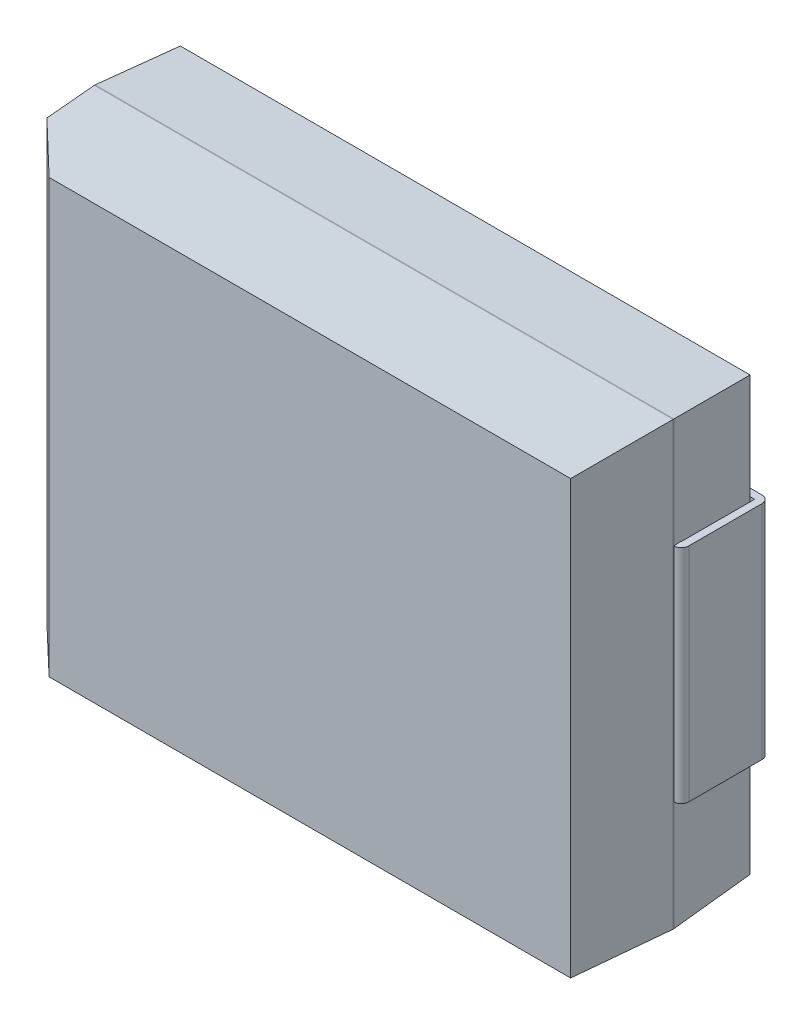
ISO-10303-21;
HEADER;
FILE_DESCRIPTION(('STEP AP214'),'2;1');
FILE_NAME('part.step','',(''),(''),'','','');
FILE_SCHEMA(('AUTOMOTIVE_DESIGN { 1 0 10303 214 1 1 1 1 }'));
ENDSEC;
DATA;
#1=APPLICATION_CONTEXT('core data for automotive mechanical design processes');
#2=APPLICATION_PROTOCOL_DEFINITION('international standard','automotive_design',2000,#1);
#3=PRODUCT_CONTEXT('',#1,'mechanical');
#4=PRODUCT('Part','Part','',(#3));
#5=PRODUCT_RELATED_PRODUCT_CATEGORY('part','',(#4));
#6=PRODUCT_DEFINITION_FORMATION('','',#4);
#7=PRODUCT_DEFINITION_CONTEXT('part definition',#1,'design');
#8=PRODUCT_DEFINITION('design','',#6,#7);
#9=PRODUCT_DEFINITION_SHAPE('','',#8);
#10=(LENGTH_UNIT() NAMED_UNIT(*) SI_UNIT(.MILLI.,.METRE.));
#11=(NAMED_UNIT(*) PLANE_ANGLE_UNIT() SI_UNIT($,.RADIAN.));
#12=(NAMED_UNIT(*) SI_UNIT($,.STERADIAN.) SOLID_ANGLE_UNIT());
#13=UNCERTAINTY_MEASURE_WITH_UNIT(LENGTH_MEASURE(1.E-05),#10,'distance_accuracy_value','');
#14=(GEOMETRIC_REPRESENTATION_CONTEXT(3) GLOBAL_UNCERTAINTY_ASSIGNED_CONTEXT((#13)) GLOBAL_UNIT_ASSIGNED_CONTEXT((#10,
#11,#12)) REPRESENTATION_CONTEXT('',''));
#15=CARTESIAN_POINT('',(0.,0.,0.));
#16=DIRECTION('',(0.,0.,1.));
#17=DIRECTION('',(1.,0.,0.));
#18=AXIS2_PLACEMENT_3D('',#15,#16,#17);
#19=CARTESIAN_POINT('',(-3.502255523555,-2.8925,2.177837735722));
#20=DIRECTION('',(0.690741065302399,0.,-0.723102192435417));
#21=DIRECTION('',(-0.723102192435417,0.,-0.690741065302399));
#22=AXIS2_PLACEMENT_3D('',#19,#20,#21);
#23=PLANE('',#22);
#24=DIRECTION('',(0.72274058755792,-0.0316211745062073,0.690395643395351));
#25=VECTOR('',#24,1.);
#26=CARTESIAN_POINT('',(-3.8395110471094,2.922011047109,1.85567547144441));
#27=LINE('',#26,#25);
#28=CARTESIAN_POINT('',(-3.83951104710931,2.92201104710911,1.85567547144422));
#29=VERTEX_POINT('',#28);
#30=CARTESIAN_POINT('',(-3.16500000000004,2.8925,2.50000000000004));
#31=VERTEX_POINT('',#30);
#32=EDGE_CURVE('P0_E94',#29,#31,#27,.T.);
#33=ORIENTED_EDGE('',*,*,#32,.F.);
#34=DIRECTION('',(0.,1.,0.));
#35=VECTOR('',#34,1.);
#36=CARTESIAN_POINT('',(-3.83951104710943,-2.9525,1.85567547144402));
#37=LINE('',#36,#35);
#38=CARTESIAN_POINT('',(-3.83951104710931,-2.92201104710911,1.85567547144422));
#39=VERTEX_POINT('',#38);
#40=EDGE_CURVE('P0_E92',#29,#39,#37,.F.);
#41=ORIENTED_EDGE('',*,*,#40,.T.);
#42=DIRECTION('',(-0.72274058755792,-0.0316211745062073,-0.690395643395351));
#43=VECTOR('',#42,1.);
#44=CARTESIAN_POINT('',(-3.16500000000008,-2.8925,2.50000000000009));
#45=LINE('',#44,#43);
#46=CARTESIAN_POINT('',(-3.16500000000004,-2.8925,2.50000000000004));
#47=VERTEX_POINT('',#46);
#48=EDGE_CURVE('P0_E20',#47,#39,#45,.T.);
#49=ORIENTED_EDGE('',*,*,#48,.F.);
#50=DIRECTION('',(0.,1.,0.));
#51=VECTOR('',#50,1.);
#52=CARTESIAN_POINT('',(-3.165,-2.9525,2.5));
#53=LINE('',#52,#51);
#54=EDGE_CURVE('P0_E89',#31,#47,#53,.F.);
#55=ORIENTED_EDGE('',*,*,#54,.F.);
#56=EDGE_LOOP('',(#33,#41,#49,#55));
#57=FACE_BOUND('',#56,.T.);
#58=ADVANCED_FACE('P0_F17',(#57),#23,.F.);
#59=CARTESIAN_POINT('',(-3.87,-2.9525,2.5));
#60=DIRECTION('',(0.,0.,1.));
#61=DIRECTION('',(1.,0.,0.));
#62=AXIS2_PLACEMENT_3D('',#59,#60,#61);
#63=PLANE('',#62);
#64=DIRECTION('',(1.,0.,0.));
#65=VECTOR('',#64,1.);
#66=CARTESIAN_POINT('',(-3.87,2.89250000000002,2.5));
#67=LINE('',#66,#65);
#68=CARTESIAN_POINT('',(3.81000000000001,2.8925,2.5));
#69=VERTEX_POINT('',#68);
#70=EDGE_CURVE('P0_E100',#31,#69,#67,.T.);
#71=ORIENTED_EDGE('',*,*,#70,.F.);
#72=ORIENTED_EDGE('',*,*,#54,.T.);
#73=DIRECTION('',(1.,0.,0.));
#74=VECTOR('',#73,1.);
#75=CARTESIAN_POINT('',(-3.87,-2.89250000000002,2.5));
#76=LINE('',#75,#74);
#77=CARTESIAN_POINT('',(3.81000000000001,-2.89250000000001,2.5));
#78=VERTEX_POINT('',#77);
#79=EDGE_CURVE('P0_E98',#47,#78,#76,.T.);
#80=ORIENTED_EDGE('',*,*,#79,.T.);
#81=DIRECTION('',(0.,1.,0.));
#82=VECTOR('',#81,1.);
#83=CARTESIAN_POINT('',(3.81000000000002,-2.9525,2.5));
#84=LINE('',#83,#82);
#85=EDGE_CURVE('P0_E155',#69,#78,#84,.F.);
#86=ORIENTED_EDGE('',*,*,#85,.F.);
#87=EDGE_LOOP('',(#71,#72,#80,#86));
#88=FACE_BOUND('',#87,.T.);
#89=ADVANCED_FACE('P0_F96',(#88),#63,.T.);
#90=CARTESIAN_POINT('',(-3.84,-2.9525,1.845));
#91=DIRECTION('',(0.998952757450676,0.,-0.0457535614099251));
#92=DIRECTION('',(-0.0457535614099251,0.,-0.998952757450676));
#93=AXIS2_PLACEMENT_3D('',#90,#91,#92);
#94=PLANE('',#93);
#95=DIRECTION('',(0.0457057464819953,-0.0457057464813146,0.99790879817602));
#96=VECTOR('',#95,1.);
#97=CARTESIAN_POINT('',(-3.87,2.95249999999998,1.19));
#98=LINE('',#97,#96);
#99=CARTESIAN_POINT('',(-3.86999999999999,2.9525,1.19));
#100=VERTEX_POINT('',#99);
#101=EDGE_CURVE('P0_E116',#100,#29,#98,.T.);
#102=ORIENTED_EDGE('',*,*,#101,.F.);
#103=DIRECTION('',(0.,1.,0.));
#104=VECTOR('',#103,1.);
#105=CARTESIAN_POINT('',(-3.87,-2.9525,1.19));
#106=LINE('',#105,#104);
#107=CARTESIAN_POINT('',(-3.86999999999999,-2.9525,1.19));
#108=VERTEX_POINT('',#107);
#109=EDGE_CURVE('P0_E120',#100,#108,#106,.F.);
#110=ORIENTED_EDGE('',*,*,#109,.T.);
#111=DIRECTION('',(0.0457057464819953,0.0457057464813146,0.99790879817602));
#112=VECTOR('',#111,1.);
#113=CARTESIAN_POINT('',(-3.87,-2.95249999999998,1.19));
#114=LINE('',#113,#112);
#115=EDGE_CURVE('P0_E106',#108,#39,#114,.T.);
#116=ORIENTED_EDGE('',*,*,#115,.T.);
#117=ORIENTED_EDGE('',*,*,#40,.F.);
#118=EDGE_LOOP('',(#102,#110,#116,#117));
#119=FACE_BOUND('',#118,.T.);
#120=ADVANCED_FACE('P0_F118',(#119),#94,.F.);
#121=CARTESIAN_POINT('',(-3.87,-2.9225,1.845));
#122=DIRECTION('',(0.,0.998952757450676,-0.0457535614099251));
#123=DIRECTION('',(0.,0.0457535614099251,0.998952757450676));
#124=AXIS2_PLACEMENT_3D('',#121,#122,#123);
#125=PLANE('',#124);
#126=DIRECTION('',(1.,0.,0.));
#127=VECTOR('',#126,1.);
#128=CARTESIAN_POINT('',(-3.87,-2.9525,1.19));
#129=LINE('',#128,#127);
#130=CARTESIAN_POINT('',(3.87,-2.95249999999999,1.19));
#131=VERTEX_POINT('',#130);
#132=EDGE_CURVE('P0_E122',#108,#131,#129,.T.);
#133=ORIENTED_EDGE('',*,*,#132,.T.);
#134=DIRECTION('',(0.0457057464813161,-0.0457057464813459,-0.99790879817605));
#135=VECTOR('',#134,1.);
#136=CARTESIAN_POINT('',(3.81000000000002,-2.8925,2.5));
#137=LINE('',#136,#135);
#138=EDGE_CURVE('P0_E105',#78,#131,#137,.T.);
#139=ORIENTED_EDGE('',*,*,#138,.F.);
#140=ORIENTED_EDGE('',*,*,#79,.F.);
#141=ORIENTED_EDGE('',*,*,#48,.T.);
#142=ORIENTED_EDGE('',*,*,#115,.F.);
#143=EDGE_LOOP('',(#133,#139,#140,#141,#142));
#144=FACE_BOUND('',#143,.T.);
#145=ADVANCED_FACE('P0_F104',(#144),#125,.F.);
#146=CARTESIAN_POINT('',(3.84,-2.9525,1.845));
#147=DIRECTION('',(0.998952757450676,0.,0.0457535614099251));
#148=DIRECTION('',(0.0457535614099251,0.,-0.998952757450676));
#149=AXIS2_PLACEMENT_3D('',#146,#147,#148);
#150=PLANE('',#149);
#151=DIRECTION('',(0.0457057464813459,0.0457057464813161,-0.99790879817605));
#152=VECTOR('',#151,1.);
#153=CARTESIAN_POINT('',(3.81,2.89250000000002,2.5));
#154=LINE('',#153,#152);
#155=CARTESIAN_POINT('',(3.86999999999999,2.9525,1.19));
#156=VERTEX_POINT('',#155);
#157=EDGE_CURVE('P0_E152',#69,#156,#154,.T.);
#158=ORIENTED_EDGE('',*,*,#157,.F.);
#159=ORIENTED_EDGE('',*,*,#85,.T.);
#160=ORIENTED_EDGE('',*,*,#138,.T.);
#161=DIRECTION('',(0.,1.,0.));
#162=VECTOR('',#161,1.);
#163=CARTESIAN_POINT('',(3.87,-2.9525,1.19));
#164=LINE('',#163,#162);
#165=EDGE_CURVE('P0_E133',#156,#131,#164,.F.);
#166=ORIENTED_EDGE('',*,*,#165,.F.);
#167=EDGE_LOOP('',(#158,#159,#160,#166));
#168=FACE_BOUND('',#167,.T.);
#169=ADVANCED_FACE('P0_F156',(#168),#150,.T.);
#170=CARTESIAN_POINT('',(-3.87,2.9225,1.845));
#171=DIRECTION('',(0.,0.998952757450676,0.0457535614099251));
#172=DIRECTION('',(0.,-0.0457535614099251,0.998952757450676));
#173=AXIS2_PLACEMENT_3D('',#170,#171,#172);
#174=PLANE('',#173);
#175=DIRECTION('',(1.,0.,0.));
#176=VECTOR('',#175,1.);
#177=CARTESIAN_POINT('',(-3.87,2.9525,1.19));
#178=LINE('',#177,#176);
#179=EDGE_CURVE('P0_E157',#100,#156,#178,.T.);
#180=ORIENTED_EDGE('',*,*,#179,.F.);
#181=ORIENTED_EDGE('',*,*,#101,.T.);
#182=ORIENTED_EDGE('',*,*,#32,.T.);
#183=ORIENTED_EDGE('',*,*,#70,.T.);
#184=ORIENTED_EDGE('',*,*,#157,.T.);
#185=EDGE_LOOP('',(#180,#181,#182,#183,#184));
#186=FACE_BOUND('',#185,.T.);
#187=ADVANCED_FACE('P0_F114',(#186),#174,.T.);
#188=CARTESIAN_POINT('',(-3.87,-2.9525,0.1));
#189=DIRECTION('',(1.,0.,0.));
#190=DIRECTION('',(0.,0.,-1.));
#191=AXIS2_PLACEMENT_3D('',#188,#189,#190);
#192=PLANE('',#191);
#193=DIRECTION('',(0.,0.,1.));
#194=VECTOR('',#193,1.);
#195=CARTESIAN_POINT('',(-3.87,2.9525,0.1));
#196=LINE('',#195,#194);
#197=CARTESIAN_POINT('',(-3.87,2.9525,1.18));
#198=VERTEX_POINT('',#197);
#199=EDGE_CURVE('P0_E161',#198,#100,#196,.T.);
#200=ORIENTED_EDGE('',*,*,#199,.F.);
#201=DIRECTION('',(0.,1.,0.));
#202=VECTOR('',#201,1.);
#203=CARTESIAN_POINT('',(-3.87000000000002,-2.9525,1.18));
#204=LINE('',#203,#202);
#205=CARTESIAN_POINT('',(-3.87,-2.9525,1.18));
#206=VERTEX_POINT('',#205);
#207=EDGE_CURVE('P0_E160',#206,#198,#204,.T.);
#208=ORIENTED_EDGE('',*,*,#207,.F.);
#209=DIRECTION('',(0.,0.,1.));
#210=VECTOR('',#209,1.);
#211=CARTESIAN_POINT('',(-3.87,-2.9525,0.1));
#212=LINE('',#211,#210);
#213=EDGE_CURVE('P0_E128',#206,#108,#212,.T.);
#214=ORIENTED_EDGE('',*,*,#213,.T.);
#215=ORIENTED_EDGE('',*,*,#109,.F.);
#216=EDGE_LOOP('',(#200,#208,#214,#215));
#217=FACE_BOUND('',#216,.T.);
#218=ADVANCED_FACE('P0_F195',(#217),#192,.F.);
#219=CARTESIAN_POINT('',(-3.87,-2.9525,0.1));
#220=DIRECTION('',(0.,1.,0.));
#221=DIRECTION('',(0.,0.,1.));
#222=AXIS2_PLACEMENT_3D('',#219,#220,#221);
#223=PLANE('',#222);
#224=ORIENTED_EDGE('',*,*,#213,.F.);
#225=DIRECTION('',(1.,0.,0.));
#226=VECTOR('',#225,1.);
#227=CARTESIAN_POINT('',(-3.87,-2.95250000000002,1.18));
#228=LINE('',#227,#226);
#229=CARTESIAN_POINT('',(3.87,-2.95250000000001,1.18));
#230=VERTEX_POINT('',#229);
#231=EDGE_CURVE('P0_E144',#230,#206,#228,.F.);
#232=ORIENTED_EDGE('',*,*,#231,.F.);
#233=DIRECTION('',(0.,0.,-1.));
#234=VECTOR('',#233,1.);
#235=CARTESIAN_POINT('',(3.87,-2.9525,0.1));
#236=LINE('',#235,#234);
#237=EDGE_CURVE('P0_E127',#131,#230,#236,.T.);
#238=ORIENTED_EDGE('',*,*,#237,.F.);
#239=ORIENTED_EDGE('',*,*,#132,.F.);
#240=EDGE_LOOP('',(#224,#232,#238,#239));
#241=FACE_BOUND('',#240,.T.);
#242=ADVANCED_FACE('P0_F142',(#241),#223,.F.);
#243=CARTESIAN_POINT('',(3.87,-2.9525,0.1));
#244=DIRECTION('',(1.,0.,0.));
#245=DIRECTION('',(0.,0.,-1.));
#246=AXIS2_PLACEMENT_3D('',#243,#244,#245);
#247=PLANE('',#246);
#248=DIRECTION('',(0.,0.,1.));
#249=VECTOR('',#248,1.);
#250=CARTESIAN_POINT('',(3.87,2.9525,0.1));
#251=LINE('',#250,#249);
#252=CARTESIAN_POINT('',(3.87000000000001,2.9525,1.18));
#253=VERTEX_POINT('',#252);
#254=EDGE_CURVE('P0_E137',#156,#253,#251,.F.);
#255=ORIENTED_EDGE('',*,*,#254,.F.);
#256=ORIENTED_EDGE('',*,*,#165,.T.);
#257=ORIENTED_EDGE('',*,*,#237,.T.);
#258=DIRECTION('',(0.,1.,0.));
#259=VECTOR('',#258,1.);
#260=CARTESIAN_POINT('',(3.87000000000002,-2.9525,1.18));
#261=LINE('',#260,#259);
#262=EDGE_CURVE('P0_E169',#230,#253,#261,.T.);
#263=ORIENTED_EDGE('',*,*,#262,.T.);
#264=EDGE_LOOP('',(#255,#256,#257,#263));
#265=FACE_BOUND('',#264,.T.);
#266=ADVANCED_FACE('P0_F134',(#265),#247,.T.);
#267=CARTESIAN_POINT('',(-3.87,2.9525,0.1));
#268=DIRECTION('',(0.,1.,0.));
#269=DIRECTION('',(0.,0.,1.));
#270=AXIS2_PLACEMENT_3D('',#267,#268,#269);
#271=PLANE('',#270);
#272=ORIENTED_EDGE('',*,*,#199,.T.);
#273=ORIENTED_EDGE('',*,*,#179,.T.);
#274=ORIENTED_EDGE('',*,*,#254,.T.);
#275=DIRECTION('',(1.,0.,0.));
#276=VECTOR('',#275,1.);
#277=CARTESIAN_POINT('',(-3.87,2.95250000000002,1.18));
#278=LINE('',#277,#276);
#279=EDGE_CURVE('P0_E168',#253,#198,#278,.F.);
#280=ORIENTED_EDGE('',*,*,#279,.T.);
#281=EDGE_LOOP('',(#272,#273,#274,#280));
#282=FACE_BOUND('',#281,.T.);
#283=ADVANCED_FACE('P0_F167',(#282),#271,.T.);
#284=CARTESIAN_POINT('',(-3.84,-2.9525,0.64));
#285=DIRECTION('',(-0.99846035320541,0.,-0.0554700196225628));
#286=DIRECTION('',(-0.0554700196225628,0.,0.99846035320541));
#287=AXIS2_PLACEMENT_3D('',#284,#285,#286);
#288=PLANE('',#287);
#289=DIRECTION('',(0.0553848775621713,-0.0553848775622113,-0.996927796119078));
#290=VECTOR('',#289,1.);
#291=CARTESIAN_POINT('',(-3.87,2.95250000000002,1.18));
#292=LINE('',#291,#290);
#293=CARTESIAN_POINT('',(-3.80999999999999,2.89249999999999,0.100000000000001));
#294=VERTEX_POINT('',#293);
#295=EDGE_CURVE('P0_E177',#198,#294,#292,.T.);
#296=ORIENTED_EDGE('',*,*,#295,.T.);
#297=DIRECTION('',(0.,1.,0.));
#298=VECTOR('',#297,1.);
#299=CARTESIAN_POINT('',(-3.81,-2.9525,0.1));
#300=LINE('',#299,#298);
#301=CARTESIAN_POINT('',(-3.80999999999999,-2.89249999999999,0.100000000000001));
#302=VERTEX_POINT('',#301);
#303=EDGE_CURVE('P0_E199',#294,#302,#300,.F.);
#304=ORIENTED_EDGE('',*,*,#303,.T.);
#305=DIRECTION('',(0.0553848775621713,0.0553848775622113,-0.996927796119078));
#306=VECTOR('',#305,1.);
#307=CARTESIAN_POINT('',(-3.87,-2.95250000000002,1.18));
#308=LINE('',#307,#306);
#309=EDGE_CURVE('P0_E186',#206,#302,#308,.T.);
#310=ORIENTED_EDGE('',*,*,#309,.F.);
#311=ORIENTED_EDGE('',*,*,#207,.T.);
#312=EDGE_LOOP('',(#296,#304,#310,#311));
#313=FACE_BOUND('',#312,.T.);
#314=ADVANCED_FACE('P0_F198',(#313),#288,.T.);
#315=CARTESIAN_POINT('',(-3.87,-2.9225,0.64));
#316=DIRECTION('',(0.,-0.99846035320541,-0.0554700196225628));
#317=DIRECTION('',(0.,0.0554700196225628,-0.99846035320541));
#318=AXIS2_PLACEMENT_3D('',#315,#316,#317);
#319=PLANE('',#318);
#320=ORIENTED_EDGE('',*,*,#231,.T.);
#321=ORIENTED_EDGE('',*,*,#309,.T.);
#322=DIRECTION('',(1.,0.,0.));
#323=VECTOR('',#322,1.);
#324=CARTESIAN_POINT('',(-3.87,-2.8925,0.1));
#325=LINE('',#324,#323);
#326=CARTESIAN_POINT('',(3.80999999999999,-2.89249999999999,0.100000000000001));
#327=VERTEX_POINT('',#326);
#328=EDGE_CURVE('P0_E201',#302,#327,#325,.T.);
#329=ORIENTED_EDGE('',*,*,#328,.T.);
#330=DIRECTION('',(0.0553848775622113,-0.0553848775621713,0.996927796119078));
#331=VECTOR('',#330,1.);
#332=CARTESIAN_POINT('',(3.80999999999998,-2.8925,0.100000000000001));
#333=LINE('',#332,#331);
#334=EDGE_CURVE('P0_E172',#327,#230,#333,.T.);
#335=ORIENTED_EDGE('',*,*,#334,.T.);
#336=EDGE_LOOP('',(#320,#321,#329,#335));
#337=FACE_BOUND('',#336,.T.);
#338=ADVANCED_FACE('P0_F189',(#337),#319,.T.);
#339=CARTESIAN_POINT('',(3.84,-2.9525,0.64));
#340=DIRECTION('',(-0.99846035320541,0.,0.0554700196225628));
#341=DIRECTION('',(0.0554700196225628,0.,0.99846035320541));
#342=AXIS2_PLACEMENT_3D('',#339,#340,#341);
#343=PLANE('',#342);
#344=DIRECTION('',(0.0553848775621713,0.0553848775622113,0.996927796119078));
#345=VECTOR('',#344,1.);
#346=CARTESIAN_POINT('',(3.81,2.89249999999998,0.100000000000001));
#347=LINE('',#346,#345);
#348=CARTESIAN_POINT('',(3.80999999999999,2.89249999999999,0.100000000000001));
#349=VERTEX_POINT('',#348);
#350=EDGE_CURVE('P0_E34',#349,#253,#347,.T.);
#351=ORIENTED_EDGE('',*,*,#350,.T.);
#352=ORIENTED_EDGE('',*,*,#262,.F.);
#353=ORIENTED_EDGE('',*,*,#334,.F.);
#354=DIRECTION('',(0.,1.,0.));
#355=VECTOR('',#354,1.);
#356=CARTESIAN_POINT('',(3.81,-2.9525,0.1));
#357=LINE('',#356,#355);
#358=EDGE_CURVE('P0_E26',#327,#349,#357,.T.);
#359=ORIENTED_EDGE('',*,*,#358,.T.);
#360=EDGE_LOOP('',(#351,#352,#353,#359));
#361=FACE_BOUND('',#360,.T.);
#362=ADVANCED_FACE('P0_F180',(#361),#343,.F.);
#363=CARTESIAN_POINT('',(-3.87,2.9225,0.64));
#364=DIRECTION('',(0.,-0.99846035320541,0.0554700196225628));
#365=DIRECTION('',(0.,-0.0554700196225628,-0.99846035320541));
#366=AXIS2_PLACEMENT_3D('',#363,#364,#365);
#367=PLANE('',#366);
#368=ORIENTED_EDGE('',*,*,#279,.F.);
#369=ORIENTED_EDGE('',*,*,#350,.F.);
#370=DIRECTION('',(1.,0.,0.));
#371=VECTOR('',#370,1.);
#372=CARTESIAN_POINT('',(-3.87,2.8925,0.1));
#373=LINE('',#372,#371);
#374=EDGE_CURVE('P0_E11',#349,#294,#373,.F.);
#375=ORIENTED_EDGE('',*,*,#374,.T.);
#376=ORIENTED_EDGE('',*,*,#295,.F.);
#377=EDGE_LOOP('',(#368,#369,#375,#376));
#378=FACE_BOUND('',#377,.T.);
#379=ADVANCED_FACE('P0_F175',(#378),#367,.F.);
#380=CARTESIAN_POINT('',(-3.87,-2.9525,0.1));
#381=DIRECTION('',(0.,0.,1.));
#382=DIRECTION('',(1.,0.,0.));
#383=AXIS2_PLACEMENT_3D('',#380,#381,#382);
#384=PLANE('',#383);
#385=ORIENTED_EDGE('',*,*,#358,.F.);
#386=ORIENTED_EDGE('',*,*,#328,.F.);
#387=ORIENTED_EDGE('',*,*,#303,.F.);
#388=ORIENTED_EDGE('',*,*,#374,.F.);
#389=EDGE_LOOP('',(#385,#386,#387,#388));
#390=FACE_BOUND('',#389,.T.);
#391=ADVANCED_FACE('P0_F205',(#390),#384,.F.);
#392=CLOSED_SHELL('',(#58,#89,#120,#145,#169,#187,#218,#242,#266,#283,#314,#338,#362,#379,#391));
#393=MANIFOLD_SOLID_BREP('P0_B1',#392);
#394=CARTESIAN_POINT('',(2.83,-1.4825,1.08));
#395=DIRECTION('',(1.,0.,0.));
#396=DIRECTION('',(0.,0.,-1.));
#397=AXIS2_PLACEMENT_3D('',#394,#395,#396);
#398=PLANE('',#397);
#399=DIRECTION('',(0.,0.,-1.));
#400=VECTOR('',#399,1.);
#401=CARTESIAN_POINT('',(2.83,1.4825,1.08));
#402=LINE('',#401,#400);
#403=CARTESIAN_POINT('',(2.83,1.4825,1.08));
#404=VERTEX_POINT('',#403);
#405=CARTESIAN_POINT('',(2.83,1.4825,1.18));
#406=VERTEX_POINT('',#405);
#407=EDGE_CURVE('P1_E117',#404,#406,#402,.F.);
#408=ORIENTED_EDGE('',*,*,#407,.F.);
#409=DIRECTION('',(0.,1.,0.));
#410=VECTOR('',#409,1.);
#411=CARTESIAN_POINT('',(2.83,-1.4825,1.08));
#412=LINE('',#411,#410);
#413=CARTESIAN_POINT('',(2.83,-1.4825,1.08));
#414=VERTEX_POINT('',#413);
#415=EDGE_CURVE('P1_E115',#404,#414,#412,.F.);
#416=ORIENTED_EDGE('',*,*,#415,.T.);
#417=DIRECTION('',(0.,0.,-1.));
#418=VECTOR('',#417,1.);
#419=CARTESIAN_POINT('',(2.83,-1.4825,1.08));
#420=LINE('',#419,#418);
#421=CARTESIAN_POINT('',(2.83,-1.4825,1.18));
#422=VERTEX_POINT('',#421);
#423=EDGE_CURVE('P1_E96',#422,#414,#420,.T.);
#424=ORIENTED_EDGE('',*,*,#423,.F.);
#425=DIRECTION('',(0.,1.,0.));
#426=VECTOR('',#425,1.);
#427=CARTESIAN_POINT('',(2.83,0.,1.18));
#428=LINE('',#427,#426);
#429=EDGE_CURVE('P1_E112',#406,#422,#428,.F.);
#430=ORIENTED_EDGE('',*,*,#429,.F.);
#431=EDGE_LOOP('',(#408,#416,#424,#430));
#432=FACE_BOUND('',#431,.T.);
#433=ADVANCED_FACE('P1_F17',(#432),#398,.F.);
#434=CARTESIAN_POINT('',(2.83,-1.4825,1.08));
#435=DIRECTION('',(0.,0.,1.));
#436=DIRECTION('',(1.,0.,0.));
#437=AXIS2_PLACEMENT_3D('',#434,#435,#436);
#438=PLANE('',#437);
#439=DIRECTION('',(0.,1.,0.));
#440=VECTOR('',#439,1.);
#441=CARTESIAN_POINT('',(3.87,-1.4825,1.08));
#442=LINE('',#441,#440);
#443=CARTESIAN_POINT('',(3.87,1.4825,1.08));
#444=VERTEX_POINT('',#443);
#445=CARTESIAN_POINT('',(3.87,-1.4825,1.08));
#446=VERTEX_POINT('',#445);
#447=EDGE_CURVE('P1_E153',#444,#446,#442,.F.);
#448=ORIENTED_EDGE('',*,*,#447,.T.);
#449=DIRECTION('',(1.,0.,0.));
#450=VECTOR('',#449,1.);
#451=CARTESIAN_POINT('',(2.83,-1.4825,1.08));
#452=LINE('',#451,#450);
#453=EDGE_CURVE('P1_E137',#414,#446,#452,.T.);
#454=ORIENTED_EDGE('',*,*,#453,.F.);
#455=ORIENTED_EDGE('',*,*,#415,.F.);
#456=DIRECTION('',(1.,0.,0.));
#457=VECTOR('',#456,1.);
#458=CARTESIAN_POINT('',(2.83,1.4825,1.08));
#459=LINE('',#458,#457);
#460=EDGE_CURVE('P1_E108',#444,#404,#459,.F.);
#461=ORIENTED_EDGE('',*,*,#460,.F.);
#462=EDGE_LOOP('',(#448,#454,#455,#461));
#463=FACE_BOUND('',#462,.T.);
#464=ADVANCED_FACE('P1_F174',(#463),#438,.F.);
#465=CARTESIAN_POINT('',(3.4,0.,1.18));
#466=DIRECTION('',(0.,0.,1.));
#467=DIRECTION('',(1.,0.,0.));
#468=AXIS2_PLACEMENT_3D('',#465,#466,#467);
#469=PLANE('',#468);
#470=DIRECTION('',(1.,0.,0.));
#471=VECTOR('',#470,1.);
#472=CARTESIAN_POINT('',(3.4,1.4825,1.18));
#473=LINE('',#472,#471);
#474=CARTESIAN_POINT('',(3.87,1.4825,1.18));
#475=VERTEX_POINT('',#474);
#476=EDGE_CURVE('P1_E107',#475,#406,#473,.F.);
#477=ORIENTED_EDGE('',*,*,#476,.T.);
#478=ORIENTED_EDGE('',*,*,#429,.T.);
#479=DIRECTION('',(1.,0.,0.));
#480=VECTOR('',#479,1.);
#481=CARTESIAN_POINT('',(3.4,-1.4825,1.18));
#482=LINE('',#481,#480);
#483=CARTESIAN_POINT('',(3.87,-1.4825,1.18));
#484=VERTEX_POINT('',#483);
#485=EDGE_CURVE('P1_E99',#422,#484,#482,.T.);
#486=ORIENTED_EDGE('',*,*,#485,.T.);
#487=DIRECTION('',(0.,1.,0.));
#488=VECTOR('',#487,1.);
#489=CARTESIAN_POINT('',(3.87,-1.4825,1.18));
#490=LINE('',#489,#488);
#491=EDGE_CURVE('P1_E146',#475,#484,#490,.F.);
#492=ORIENTED_EDGE('',*,*,#491,.F.);
#493=EDGE_LOOP('',(#477,#478,#486,#492));
#494=FACE_BOUND('',#493,.T.);
#495=ADVANCED_FACE('P1_F119',(#494),#469,.T.);
#496=CARTESIAN_POINT('',(3.87,-1.4825,0.));
#497=DIRECTION('',(1.,0.,0.));
#498=DIRECTION('',(0.,0.,-1.));
#499=AXIS2_PLACEMENT_3D('',#496,#497,#498);
#500=PLANE('',#499);
#501=DIRECTION('',(0.,0.,-1.));
#502=VECTOR('',#501,1.);
#503=CARTESIAN_POINT('',(3.87,1.4825,0.));
#504=LINE('',#503,#502);
#505=CARTESIAN_POINT('',(3.87,1.4825,0.1));
#506=VERTEX_POINT('',#505);
#507=EDGE_CURVE('P1_E122',#506,#444,#504,.F.);
#508=ORIENTED_EDGE('',*,*,#507,.F.);
#509=DIRECTION('',(0.,1.,0.));
#510=VECTOR('',#509,1.);
#511=CARTESIAN_POINT('',(3.87,-1.4825,0.1));
#512=LINE('',#511,#510);
#513=CARTESIAN_POINT('',(3.87,-1.4825,0.1));
#514=VERTEX_POINT('',#513);
#515=EDGE_CURVE('P1_E145',#514,#506,#512,.T.);
#516=ORIENTED_EDGE('',*,*,#515,.F.);
#517=DIRECTION('',(0.,0.,-1.));
#518=VECTOR('',#517,1.);
#519=CARTESIAN_POINT('',(3.87,-1.4825,0.));
#520=LINE('',#519,#518);
#521=EDGE_CURVE('P1_E120',#446,#514,#520,.T.);
#522=ORIENTED_EDGE('',*,*,#521,.F.);
#523=ORIENTED_EDGE('',*,*,#447,.F.);
#524=EDGE_LOOP('',(#508,#516,#522,#523));
#525=FACE_BOUND('',#524,.T.);
#526=ADVANCED_FACE('P1_F176',(#525),#500,.F.);
#527=CARTESIAN_POINT('',(3.87,-1.4825,1.08));
#528=DIRECTION('',(0.,1.,0.));
#529=DIRECTION('',(0.,0.,1.));
#530=AXIS2_PLACEMENT_3D('',#527,#528,#529);
#531=CYLINDRICAL_SURFACE('',#530,0.1);
#532=ORIENTED_EDGE('',*,*,#491,.T.);
#533=CARTESIAN_POINT('',(3.87,-1.4825,1.08));
#534=DIRECTION('',(0.,1.,0.));
#535=DIRECTION('',(0.,0.,1.));
#536=AXIS2_PLACEMENT_3D('',#533,#534,#535);
#537=CIRCLE('',#536,0.1);
#538=CARTESIAN_POINT('',(3.97,-1.4825,1.08));
#539=VERTEX_POINT('',#538);
#540=EDGE_CURVE('P1_E102',#484,#539,#537,.T.);
#541=ORIENTED_EDGE('',*,*,#540,.T.);
#542=DIRECTION('',(0.,1.,0.));
#543=VECTOR('',#542,1.);
#544=CARTESIAN_POINT('',(3.97,-1.4825,1.08));
#545=LINE('',#544,#543);
#546=CARTESIAN_POINT('',(3.97,1.4825,1.08));
#547=VERTEX_POINT('',#546);
#548=EDGE_CURVE('P1_E187',#547,#539,#545,.F.);
#549=ORIENTED_EDGE('',*,*,#548,.F.);
#550=CARTESIAN_POINT('',(3.87,1.4825,1.08));
#551=DIRECTION('',(0.,1.,0.));
#552=DIRECTION('',(0.,0.,1.));
#553=AXIS2_PLACEMENT_3D('',#550,#551,#552);
#554=CIRCLE('',#553,0.1);
#555=EDGE_CURVE('P1_E20',#547,#475,#554,.F.);
#556=ORIENTED_EDGE('',*,*,#555,.T.);
#557=EDGE_LOOP('',(#532,#541,#549,#556));
#558=FACE_BOUND('',#557,.T.);
#559=ADVANCED_FACE('P1_F292',(#558),#531,.T.);
#560=CARTESIAN_POINT('',(2.73,-1.4825,0.1));
#561=DIRECTION('',(0.,0.,1.));
#562=DIRECTION('',(1.,0.,0.));
#563=AXIS2_PLACEMENT_3D('',#560,#561,#562);
#564=PLANE('',#563);
#565=ORIENTED_EDGE('',*,*,#515,.T.);
#566=DIRECTION('',(1.,0.,0.));
#567=VECTOR('',#566,1.);
#568=CARTESIAN_POINT('',(2.73,1.4825,0.1));
#569=LINE('',#568,#567);
#570=CARTESIAN_POINT('',(2.73,1.4825,0.1));
#571=VERTEX_POINT('',#570);
#572=EDGE_CURVE('P1_E150',#506,#571,#569,.F.);
#573=ORIENTED_EDGE('',*,*,#572,.T.);
#574=DIRECTION('',(0.,1.,0.));
#575=VECTOR('',#574,1.);
#576=CARTESIAN_POINT('',(2.73,-1.4825,0.1));
#577=LINE('',#576,#575);
#578=CARTESIAN_POINT('',(2.73,-1.4825,0.1));
#579=VERTEX_POINT('',#578);
#580=EDGE_CURVE('P1_E181',#571,#579,#577,.F.);
#581=ORIENTED_EDGE('',*,*,#580,.T.);
#582=DIRECTION('',(1.,0.,0.));
#583=VECTOR('',#582,1.);
#584=CARTESIAN_POINT('',(3.51289017341,-1.4825,0.1));
#585=LINE('',#584,#583);
#586=EDGE_CURVE('P1_E74',#514,#579,#585,.F.);
#587=ORIENTED_EDGE('',*,*,#586,.F.);
#588=EDGE_LOOP('',(#565,#573,#581,#587));
#589=FACE_BOUND('',#588,.T.);
#590=ADVANCED_FACE('P1_F179',(#589),#564,.T.);
#591=CARTESIAN_POINT('',(3.97,-1.4825,0.));
#592=DIRECTION('',(1.,0.,0.));
#593=DIRECTION('',(0.,0.,-1.));
#594=AXIS2_PLACEMENT_3D('',#591,#592,#593);
#595=PLANE('',#594);
#596=DIRECTION('',(0.,0.,1.));
#597=VECTOR('',#596,1.);
#598=CARTESIAN_POINT('',(3.97,1.4825,0.574393063584));
#599=LINE('',#598,#597);
#600=CARTESIAN_POINT('',(3.97,1.4825,0.1));
#601=VERTEX_POINT('',#600);
#602=EDGE_CURVE('P1_E205',#547,#601,#599,.F.);
#603=ORIENTED_EDGE('',*,*,#602,.F.);
#604=ORIENTED_EDGE('',*,*,#548,.T.);
#605=DIRECTION('',(0.,0.,1.));
#606=VECTOR('',#605,1.);
#607=CARTESIAN_POINT('',(3.97,-1.4825,0.574393063584));
#608=LINE('',#607,#606);
#609=CARTESIAN_POINT('',(3.97,-1.4825,0.1));
#610=VERTEX_POINT('',#609);
#611=EDGE_CURVE('P1_E184',#610,#539,#608,.T.);
#612=ORIENTED_EDGE('',*,*,#611,.F.);
#613=DIRECTION('',(0.,1.,0.));
#614=VECTOR('',#613,1.);
#615=CARTESIAN_POINT('',(3.97,-1.4825,0.1));
#616=LINE('',#615,#614);
#617=EDGE_CURVE('P1_E141',#601,#610,#616,.F.);
#618=ORIENTED_EDGE('',*,*,#617,.F.);
#619=EDGE_LOOP('',(#603,#604,#612,#618));
#620=FACE_BOUND('',#619,.T.);
#621=ADVANCED_FACE('P1_F230',(#620),#595,.T.);
#622=CARTESIAN_POINT('',(3.51289017341,-1.4825,0.574393063584));
#623=DIRECTION('',(0.,-1.,0.));
#624=DIRECTION('',(1.,0.,0.));
#625=AXIS2_PLACEMENT_3D('',#622,#623,#624);
#626=PLANE('',#625);
#627=ORIENTED_EDGE('',*,*,#586,.T.);
#628=DIRECTION('',(0.,0.,-1.));
#629=VECTOR('',#628,1.);
#630=CARTESIAN_POINT('',(2.73,-1.4825,0.));
#631=LINE('',#630,#629);
#632=CARTESIAN_POINT('',(2.73,-1.4825,0.));
#633=VERTEX_POINT('',#632);
#634=EDGE_CURVE('P1_E183',#579,#633,#631,.T.);
#635=ORIENTED_EDGE('',*,*,#634,.T.);
#636=DIRECTION('',(-1.,0.,0.));
#637=VECTOR('',#636,1.);
#638=CARTESIAN_POINT('',(3.35,-1.4825,0.));
#639=LINE('',#638,#637);
#640=CARTESIAN_POINT('',(3.87,-1.4825,0.));
#641=VERTEX_POINT('',#640);
#642=EDGE_CURVE('P1_E207',#641,#633,#639,.T.);
#643=ORIENTED_EDGE('',*,*,#642,.F.);
#644=CARTESIAN_POINT('',(3.87,-1.4825,0.1));
#645=DIRECTION('',(0.,1.,0.));
#646=DIRECTION('',(0.,0.,1.));
#647=AXIS2_PLACEMENT_3D('',#644,#645,#646);
#648=CIRCLE('',#647,0.1);
#649=EDGE_CURVE('P1_E142',#610,#641,#648,.T.);
#650=ORIENTED_EDGE('',*,*,#649,.F.);
#651=ORIENTED_EDGE('',*,*,#611,.T.);
#652=ORIENTED_EDGE('',*,*,#540,.F.);
#653=ORIENTED_EDGE('',*,*,#485,.F.);
#654=ORIENTED_EDGE('',*,*,#423,.T.);
#655=ORIENTED_EDGE('',*,*,#453,.T.);
#656=ORIENTED_EDGE('',*,*,#521,.T.);
#657=EDGE_LOOP('',(#627,#635,#643,#650,#651,#652,#653,#654,#655,#656));
#658=FACE_BOUND('',#657,.T.);
#659=ADVANCED_FACE('P1_F100',(#658),#626,.T.);
#660=CARTESIAN_POINT('',(2.73,-1.4825,0.));
#661=DIRECTION('',(1.,0.,0.));
#662=DIRECTION('',(0.,0.,-1.));
#663=AXIS2_PLACEMENT_3D('',#660,#661,#662);
#664=PLANE('',#663);
#665=DIRECTION('',(0.,0.,1.));
#666=VECTOR('',#665,1.);
#667=CARTESIAN_POINT('',(2.73,1.4825,0.574393063584));
#668=LINE('',#667,#666);
#669=CARTESIAN_POINT('',(2.73,1.4825,0.));
#670=VERTEX_POINT('',#669);
#671=EDGE_CURVE('P1_E144',#670,#571,#668,.T.);
#672=ORIENTED_EDGE('',*,*,#671,.F.);
#673=DIRECTION('',(0.,1.,0.));
#674=VECTOR('',#673,1.);
#675=CARTESIAN_POINT('',(2.73,0.,0.));
#676=LINE('',#675,#674);
#677=EDGE_CURVE('P1_E213',#633,#670,#676,.T.);
#678=ORIENTED_EDGE('',*,*,#677,.F.);
#679=ORIENTED_EDGE('',*,*,#634,.F.);
#680=ORIENTED_EDGE('',*,*,#580,.F.);
#681=EDGE_LOOP('',(#672,#678,#679,#680));
#682=FACE_BOUND('',#681,.T.);
#683=ADVANCED_FACE('P1_F238',(#682),#664,.F.);
#684=CARTESIAN_POINT('',(3.51289017341,1.4825,0.574393063584));
#685=DIRECTION('',(0.,1.,0.));
#686=DIRECTION('',(-1.,0.,0.));
#687=AXIS2_PLACEMENT_3D('',#684,#685,#686);
#688=PLANE('',#687);
#689=ORIENTED_EDGE('',*,*,#460,.T.);
#690=ORIENTED_EDGE('',*,*,#407,.T.);
#691=ORIENTED_EDGE('',*,*,#476,.F.);
#692=ORIENTED_EDGE('',*,*,#555,.F.);
#693=ORIENTED_EDGE('',*,*,#602,.T.);
#694=CARTESIAN_POINT('',(3.87,1.4825,0.1));
#695=DIRECTION('',(0.,1.,0.));
#696=DIRECTION('',(0.,0.,1.));
#697=AXIS2_PLACEMENT_3D('',#694,#695,#696);
#698=CIRCLE('',#697,0.1);
#699=CARTESIAN_POINT('',(3.87,1.4825,0.));
#700=VERTEX_POINT('',#699);
#701=EDGE_CURVE('P1_E35',#700,#601,#698,.F.);
#702=ORIENTED_EDGE('',*,*,#701,.F.);
#703=DIRECTION('',(-1.,0.,0.));
#704=VECTOR('',#703,1.);
#705=CARTESIAN_POINT('',(3.35,1.4825,0.));
#706=LINE('',#705,#704);
#707=EDGE_CURVE('P1_E26',#670,#700,#706,.F.);
#708=ORIENTED_EDGE('',*,*,#707,.F.);
#709=ORIENTED_EDGE('',*,*,#671,.T.);
#710=ORIENTED_EDGE('',*,*,#572,.F.);
#711=ORIENTED_EDGE('',*,*,#507,.T.);
#712=EDGE_LOOP('',(#689,#690,#691,#692,#693,#702,#708,#709,#710,#711));
#713=FACE_BOUND('',#712,.T.);
#714=ADVANCED_FACE('P1_F198',(#713),#688,.T.);
#715=CARTESIAN_POINT('',(3.87,-1.4825,0.1));
#716=DIRECTION('',(0.,1.,0.));
#717=DIRECTION('',(0.,0.,1.));
#718=AXIS2_PLACEMENT_3D('',#715,#716,#717);
#719=CYLINDRICAL_SURFACE('',#718,0.1);
#720=ORIENTED_EDGE('',*,*,#701,.T.);
#721=ORIENTED_EDGE('',*,*,#617,.T.);
#722=ORIENTED_EDGE('',*,*,#649,.T.);
#723=DIRECTION('',(0.,1.,0.));
#724=VECTOR('',#723,1.);
#725=CARTESIAN_POINT('',(3.87,0.,0.));
#726=LINE('',#725,#724);
#727=EDGE_CURVE('P1_E11',#700,#641,#726,.F.);
#728=ORIENTED_EDGE('',*,*,#727,.F.);
#729=EDGE_LOOP('',(#720,#721,#722,#728));
#730=FACE_BOUND('',#729,.T.);
#731=ADVANCED_FACE('P1_F233',(#730),#719,.T.);
#732=CARTESIAN_POINT('',(3.35,0.,0.));
#733=DIRECTION('',(0.,0.,-1.));
#734=DIRECTION('',(-1.,0.,0.));
#735=AXIS2_PLACEMENT_3D('',#732,#733,#734);
#736=PLANE('',#735);
#737=ORIENTED_EDGE('',*,*,#707,.T.);
#738=ORIENTED_EDGE('',*,*,#727,.T.);
#739=ORIENTED_EDGE('',*,*,#642,.T.);
#740=ORIENTED_EDGE('',*,*,#677,.T.);
#741=EDGE_LOOP('',(#737,#738,#739,#740));
#742=FACE_BOUND('',#741,.T.);
#743=ADVANCED_FACE('P1_F235',(#742),#736,.T.);
#744=CLOSED_SHELL('',(#433,#464,#495,#526,#559,#590,#621,#659,#683,#714,#731,#743));
#745=MANIFOLD_SOLID_BREP('P1_B1',#744);
#746=CARTESIAN_POINT('',(-2.93,-1.4825,1.08));
#747=DIRECTION('',(1.,0.,0.));
#748=DIRECTION('',(0.,0.,-1.));
#749=AXIS2_PLACEMENT_3D('',#746,#747,#748);
#750=PLANE('',#749);
#751=DIRECTION('',(0.,0.,-1.));
#752=VECTOR('',#751,1.);
#753=CARTESIAN_POINT('',(-2.93,1.4825,1.08));
#754=LINE('',#753,#752);
#755=CARTESIAN_POINT('',(-2.93,1.4825,1.08));
#756=VERTEX_POINT('',#755);
#757=CARTESIAN_POINT('',(-2.93,1.4825,1.18));
#758=VERTEX_POINT('',#757);
#759=EDGE_CURVE('P2_E101',#756,#758,#754,.F.);
#760=ORIENTED_EDGE('',*,*,#759,.T.);
#761=DIRECTION('',(0.,1.,0.));
#762=VECTOR('',#761,1.);
#763=CARTESIAN_POINT('',(-2.93,-1.4825,1.18));
#764=LINE('',#763,#762);
#765=CARTESIAN_POINT('',(-2.93,-1.4825,1.18));
#766=VERTEX_POINT('',#765);
#767=EDGE_CURVE('P2_E96',#766,#758,#764,.T.);
#768=ORIENTED_EDGE('',*,*,#767,.F.);
#769=DIRECTION('',(0.,0.,-1.));
#770=VECTOR('',#769,1.);
#771=CARTESIAN_POINT('',(-2.93,-1.4825,1.08));
#772=LINE('',#771,#770);
#773=CARTESIAN_POINT('',(-2.93,-1.4825,1.08));
#774=VERTEX_POINT('',#773);
#775=EDGE_CURVE('P2_E135',#766,#774,#772,.T.);
#776=ORIENTED_EDGE('',*,*,#775,.T.);
#777=DIRECTION('',(0.,1.,0.));
#778=VECTOR('',#777,1.);
#779=CARTESIAN_POINT('',(-2.93,-1.4825,1.08));
#780=LINE('',#779,#778);
#781=EDGE_CURVE('P2_E111',#774,#756,#780,.T.);
#782=ORIENTED_EDGE('',*,*,#781,.T.);
#783=EDGE_LOOP('',(#760,#768,#776,#782));
#784=FACE_BOUND('',#783,.T.);
#785=ADVANCED_FACE('P2_F17',(#784),#750,.T.);
#786=CARTESIAN_POINT('',(-3.97,-1.4825,1.18));
#787=DIRECTION('',(0.,0.,1.));
#788=DIRECTION('',(1.,0.,0.));
#789=AXIS2_PLACEMENT_3D('',#786,#787,#788);
#790=PLANE('',#789);
#791=DIRECTION('',(1.,0.,0.));
#792=VECTOR('',#791,1.);
#793=CARTESIAN_POINT('',(-3.97,-1.4825,1.18));
#794=LINE('',#793,#792);
#795=CARTESIAN_POINT('',(-3.87,-1.4825,1.18));
#796=VERTEX_POINT('',#795);
#797=EDGE_CURVE('P2_E100',#796,#766,#794,.T.);
#798=ORIENTED_EDGE('',*,*,#797,.T.);
#799=ORIENTED_EDGE('',*,*,#767,.T.);
#800=DIRECTION('',(1.,0.,0.));
#801=VECTOR('',#800,1.);
#802=CARTESIAN_POINT('',(-3.97,1.4825,1.18));
#803=LINE('',#802,#801);
#804=CARTESIAN_POINT('',(-3.87,1.4825,1.18));
#805=VERTEX_POINT('',#804);
#806=EDGE_CURVE('P2_E91',#758,#805,#803,.F.);
#807=ORIENTED_EDGE('',*,*,#806,.T.);
#808=DIRECTION('',(0.,1.,0.));
#809=VECTOR('',#808,1.);
#810=CARTESIAN_POINT('',(-3.87,-1.4825,1.18));
#811=LINE('',#810,#809);
#812=EDGE_CURVE('P2_E94',#796,#805,#811,.T.);
#813=ORIENTED_EDGE('',*,*,#812,.F.);
#814=EDGE_LOOP('',(#798,#799,#807,#813));
#815=FACE_BOUND('',#814,.T.);
#816=ADVANCED_FACE('P2_F93',(#815),#790,.T.);
#817=CARTESIAN_POINT('',(-3.97,-1.4825,1.08));
#818=DIRECTION('',(0.,0.,1.));
#819=DIRECTION('',(1.,0.,0.));
#820=AXIS2_PLACEMENT_3D('',#817,#818,#819);
#821=PLANE('',#820);
#822=DIRECTION('',(1.,0.,0.));
#823=VECTOR('',#822,1.);
#824=CARTESIAN_POINT('',(-3.97,-1.4825,1.08));
#825=LINE('',#824,#823);
#826=CARTESIAN_POINT('',(-3.87,-1.4825,1.08));
#827=VERTEX_POINT('',#826);
#828=EDGE_CURVE('P2_E143',#827,#774,#825,.T.);
#829=ORIENTED_EDGE('',*,*,#828,.F.);
#830=DIRECTION('',(0.,1.,0.));
#831=VECTOR('',#830,1.);
#832=CARTESIAN_POINT('',(-3.87,-1.4825,1.08));
#833=LINE('',#832,#831);
#834=CARTESIAN_POINT('',(-3.87,1.4825,1.08));
#835=VERTEX_POINT('',#834);
#836=EDGE_CURVE('P2_E155',#835,#827,#833,.F.);
#837=ORIENTED_EDGE('',*,*,#836,.F.);
#838=DIRECTION('',(1.,0.,0.));
#839=VECTOR('',#838,1.);
#840=CARTESIAN_POINT('',(-3.97,1.4825,1.08));
#841=LINE('',#840,#839);
#842=EDGE_CURVE('P2_E131',#756,#835,#841,.F.);
#843=ORIENTED_EDGE('',*,*,#842,.F.);
#844=ORIENTED_EDGE('',*,*,#781,.F.);
#845=EDGE_LOOP('',(#829,#837,#843,#844));
#846=FACE_BOUND('',#845,.T.);
#847=ADVANCED_FACE('P2_F309',(#846),#821,.F.);
#848=CARTESIAN_POINT('',(-3.87,-1.4825,1.08));
#849=DIRECTION('',(0.,1.,0.));
#850=DIRECTION('',(0.,0.,1.));
#851=AXIS2_PLACEMENT_3D('',#848,#849,#850);
#852=CYLINDRICAL_SURFACE('',#851,0.1);
#853=DIRECTION('',(0.,1.,0.));
#854=VECTOR('',#853,1.);
#855=CARTESIAN_POINT('',(-3.97,-1.4825,1.08));
#856=LINE('',#855,#854);
#857=CARTESIAN_POINT('',(-3.97,1.4825,1.08));
#858=VERTEX_POINT('',#857);
#859=CARTESIAN_POINT('',(-3.97,-1.4825,1.08));
#860=VERTEX_POINT('',#859);
#861=EDGE_CURVE('P2_E168',#858,#860,#856,.F.);
#862=ORIENTED_EDGE('',*,*,#861,.T.);
#863=CARTESIAN_POINT('',(-3.87,-1.4825,1.08));
#864=DIRECTION('',(0.,1.,0.));
#865=DIRECTION('',(0.,0.,1.));
#866=AXIS2_PLACEMENT_3D('',#863,#864,#865);
#867=CIRCLE('',#866,0.1);
#868=EDGE_CURVE('P2_E110',#860,#796,#867,.T.);
#869=ORIENTED_EDGE('',*,*,#868,.T.);
#870=ORIENTED_EDGE('',*,*,#812,.T.);
#871=CARTESIAN_POINT('',(-3.87,1.4825,1.08));
#872=DIRECTION('',(0.,1.,0.));
#873=DIRECTION('',(0.,0.,1.));
#874=AXIS2_PLACEMENT_3D('',#871,#872,#873);
#875=CIRCLE('',#874,0.1);
#876=EDGE_CURVE('P2_E20',#805,#858,#875,.F.);
#877=ORIENTED_EDGE('',*,*,#876,.T.);
#878=EDGE_LOOP('',(#862,#869,#870,#877));
#879=FACE_BOUND('',#878,.T.);
#880=ADVANCED_FACE('P2_F107',(#879),#852,.T.);
#881=CARTESIAN_POINT('',(-3.87,-1.4825,0.));
#882=DIRECTION('',(1.,0.,0.));
#883=DIRECTION('',(0.,0.,-1.));
#884=AXIS2_PLACEMENT_3D('',#881,#882,#883);
#885=PLANE('',#884);
#886=DIRECTION('',(0.,0.,-1.));
#887=VECTOR('',#886,1.);
#888=CARTESIAN_POINT('',(-3.87,1.4825,0.));
#889=LINE('',#888,#887);
#890=CARTESIAN_POINT('',(-3.87,1.4825,0.1));
#891=VERTEX_POINT('',#890);
#892=EDGE_CURVE('P2_E119',#891,#835,#889,.F.);
#893=ORIENTED_EDGE('',*,*,#892,.T.);
#894=ORIENTED_EDGE('',*,*,#836,.T.);
#895=DIRECTION('',(0.,0.,-1.));
#896=VECTOR('',#895,1.);
#897=CARTESIAN_POINT('',(-3.87,-1.4825,0.));
#898=LINE('',#897,#896);
#899=CARTESIAN_POINT('',(-3.87,-1.4825,0.1));
#900=VERTEX_POINT('',#899);
#901=EDGE_CURVE('P2_E118',#827,#900,#898,.T.);
#902=ORIENTED_EDGE('',*,*,#901,.T.);
#903=DIRECTION('',(0.,1.,0.));
#904=VECTOR('',#903,1.);
#905=CARTESIAN_POINT('',(-3.87,-1.4825,0.1));
#906=LINE('',#905,#904);
#907=EDGE_CURVE('P2_E170',#891,#900,#906,.F.);
#908=ORIENTED_EDGE('',*,*,#907,.F.);
#909=EDGE_LOOP('',(#893,#894,#902,#908));
#910=FACE_BOUND('',#909,.T.);
#911=ADVANCED_FACE('P2_F230',(#910),#885,.T.);
#912=CARTESIAN_POINT('',(-3.97,-1.4825,0.));
#913=DIRECTION('',(1.,0.,0.));
#914=DIRECTION('',(0.,0.,-1.));
#915=AXIS2_PLACEMENT_3D('',#912,#913,#914);
#916=PLANE('',#915);
#917=DIRECTION('',(0.,0.,1.));
#918=VECTOR('',#917,1.);
#919=CARTESIAN_POINT('',(-3.97,1.4825,0.573435582822));
#920=LINE('',#919,#918);
#921=CARTESIAN_POINT('',(-3.97,1.4825,0.1));
#922=VERTEX_POINT('',#921);
#923=EDGE_CURVE('P2_E117',#922,#858,#920,.T.);
#924=ORIENTED_EDGE('',*,*,#923,.F.);
#925=DIRECTION('',(0.,1.,0.));
#926=VECTOR('',#925,1.);
#927=CARTESIAN_POINT('',(-3.97,-1.4825,0.1));
#928=LINE('',#927,#926);
#929=CARTESIAN_POINT('',(-3.97,-1.4825,0.1));
#930=VERTEX_POINT('',#929);
#931=EDGE_CURVE('P2_E125',#930,#922,#928,.T.);
#932=ORIENTED_EDGE('',*,*,#931,.F.);
#933=DIRECTION('',(0.,0.,-1.));
#934=VECTOR('',#933,1.);
#935=CARTESIAN_POINT('',(-3.97,-1.4825,0.));
#936=LINE('',#935,#934);
#937=EDGE_CURVE('P2_E158',#860,#930,#936,.T.);
#938=ORIENTED_EDGE('',*,*,#937,.F.);
#939=ORIENTED_EDGE('',*,*,#861,.F.);
#940=EDGE_LOOP('',(#924,#932,#938,#939));
#941=FACE_BOUND('',#940,.T.);
#942=ADVANCED_FACE('P2_F227',(#941),#916,.F.);
#943=CARTESIAN_POINT('',(-3.97,-1.4825,0.1));
#944=DIRECTION('',(0.,0.,1.));
#945=DIRECTION('',(1.,0.,0.));
#946=AXIS2_PLACEMENT_3D('',#943,#944,#945);
#947=PLANE('',#946);
#948=DIRECTION('',(1.,0.,0.));
#949=VECTOR('',#948,1.);
#950=CARTESIAN_POINT('',(-3.557852760736,-1.4825,0.1));
#951=LINE('',#950,#949);
#952=CARTESIAN_POINT('',(-2.83,-1.4825,0.1));
#953=VERTEX_POINT('',#952);
#954=EDGE_CURVE('P2_E127',#953,#900,#951,.F.);
#955=ORIENTED_EDGE('',*,*,#954,.F.);
#956=DIRECTION('',(0.,1.,0.));
#957=VECTOR('',#956,1.);
#958=CARTESIAN_POINT('',(-2.83,-1.4825,0.1));
#959=LINE('',#958,#957);
#960=CARTESIAN_POINT('',(-2.83,1.4825,0.1));
#961=VERTEX_POINT('',#960);
#962=EDGE_CURVE('P2_E184',#961,#953,#959,.F.);
#963=ORIENTED_EDGE('',*,*,#962,.F.);
#964=DIRECTION('',(-1.,0.,0.));
#965=VECTOR('',#964,1.);
#966=CARTESIAN_POINT('',(-3.557852760736,1.4825,0.1));
#967=LINE('',#966,#965);
#968=EDGE_CURVE('P2_E173',#891,#961,#967,.F.);
#969=ORIENTED_EDGE('',*,*,#968,.F.);
#970=ORIENTED_EDGE('',*,*,#907,.T.);
#971=EDGE_LOOP('',(#955,#963,#969,#970));
#972=FACE_BOUND('',#971,.T.);
#973=ADVANCED_FACE('P2_F229',(#972),#947,.T.);
#974=CARTESIAN_POINT('',(-3.557852760736,1.4825,0.573435582822));
#975=DIRECTION('',(0.,1.,0.));
#976=DIRECTION('',(-1.,0.,0.));
#977=AXIS2_PLACEMENT_3D('',#974,#975,#976);
#978=PLANE('',#977);
#979=ORIENTED_EDGE('',*,*,#968,.T.);
#980=DIRECTION('',(0.,0.,-1.));
#981=VECTOR('',#980,1.);
#982=CARTESIAN_POINT('',(-2.83,1.4825,0.));
#983=LINE('',#982,#981);
#984=CARTESIAN_POINT('',(-2.83,1.4825,0.));
#985=VERTEX_POINT('',#984);
#986=EDGE_CURVE('P2_E187',#985,#961,#983,.F.);
#987=ORIENTED_EDGE('',*,*,#986,.F.);
#988=DIRECTION('',(1.,0.,0.));
#989=VECTOR('',#988,1.);
#990=CARTESIAN_POINT('',(-3.97,1.4825,0.));
#991=LINE('',#990,#989);
#992=CARTESIAN_POINT('',(-3.87,1.4825,0.));
#993=VERTEX_POINT('',#992);
#994=EDGE_CURVE('P2_E186',#985,#993,#991,.F.);
#995=ORIENTED_EDGE('',*,*,#994,.T.);
#996=CARTESIAN_POINT('',(-3.87,1.4825,0.1));
#997=DIRECTION('',(0.,1.,0.));
#998=DIRECTION('',(0.,0.,1.));
#999=AXIS2_PLACEMENT_3D('',#996,#997,#998);
#1000=CIRCLE('',#999,0.1);
#1001=EDGE_CURVE('P2_E122',#922,#993,#1000,.F.);
#1002=ORIENTED_EDGE('',*,*,#1001,.F.);
#1003=ORIENTED_EDGE('',*,*,#923,.T.);
#1004=ORIENTED_EDGE('',*,*,#876,.F.);
#1005=ORIENTED_EDGE('',*,*,#806,.F.);
#1006=ORIENTED_EDGE('',*,*,#759,.F.);
#1007=ORIENTED_EDGE('',*,*,#842,.T.);
#1008=ORIENTED_EDGE('',*,*,#892,.F.);
#1009=EDGE_LOOP('',(#979,#987,#995,#1002,#1003,#1004,#1005,#1006,#1007,#1008));
#1010=FACE_BOUND('',#1009,.T.);
#1011=ADVANCED_FACE('P2_F114',(#1010),#978,.T.);
#1012=CARTESIAN_POINT('',(-3.87,-1.4825,0.1));
#1013=DIRECTION('',(0.,1.,0.));
#1014=DIRECTION('',(0.,0.,1.));
#1015=AXIS2_PLACEMENT_3D('',#1012,#1013,#1014);
#1016=CYLINDRICAL_SURFACE('',#1015,0.1);
#1017=DIRECTION('',(0.,1.,0.));
#1018=VECTOR('',#1017,1.);
#1019=CARTESIAN_POINT('',(-3.87,-1.4825,0.));
#1020=LINE('',#1019,#1018);
#1021=CARTESIAN_POINT('',(-3.87,-1.4825,0.));
#1022=VERTEX_POINT('',#1021);
#1023=EDGE_CURVE('P2_E200',#993,#1022,#1020,.F.);
#1024=ORIENTED_EDGE('',*,*,#1023,.T.);
#1025=CARTESIAN_POINT('',(-3.87,-1.4825,0.1));
#1026=DIRECTION('',(0.,1.,0.));
#1027=DIRECTION('',(0.,0.,1.));
#1028=AXIS2_PLACEMENT_3D('',#1025,#1026,#1027);
#1029=CIRCLE('',#1028,0.1);
#1030=EDGE_CURVE('P2_E124',#930,#1022,#1029,.F.);
#1031=ORIENTED_EDGE('',*,*,#1030,.F.);
#1032=ORIENTED_EDGE('',*,*,#931,.T.);
#1033=ORIENTED_EDGE('',*,*,#1001,.T.);
#1034=EDGE_LOOP('',(#1024,#1031,#1032,#1033));
#1035=FACE_BOUND('',#1034,.T.);
#1036=ADVANCED_FACE('P2_F214',(#1035),#1016,.T.);
#1037=CARTESIAN_POINT('',(-3.557852760736,-1.4825,0.573435582822));
#1038=DIRECTION('',(0.,-1.,0.));
#1039=DIRECTION('',(1.,0.,0.));
#1040=AXIS2_PLACEMENT_3D('',#1037,#1038,#1039);
#1041=PLANE('',#1040);
#1042=ORIENTED_EDGE('',*,*,#828,.T.);
#1043=ORIENTED_EDGE('',*,*,#775,.F.);
#1044=ORIENTED_EDGE('',*,*,#797,.F.);
#1045=ORIENTED_EDGE('',*,*,#868,.F.);
#1046=ORIENTED_EDGE('',*,*,#937,.T.);
#1047=ORIENTED_EDGE('',*,*,#1030,.T.);
#1048=DIRECTION('',(1.,0.,0.));
#1049=VECTOR('',#1048,1.);
#1050=CARTESIAN_POINT('',(-3.97,-1.4825,0.));
#1051=LINE('',#1050,#1049);
#1052=CARTESIAN_POINT('',(-2.83,-1.4825,0.));
#1053=VERTEX_POINT('',#1052);
#1054=EDGE_CURVE('P2_E26',#1022,#1053,#1051,.T.);
#1055=ORIENTED_EDGE('',*,*,#1054,.T.);
#1056=DIRECTION('',(0.,0.,-1.));
#1057=VECTOR('',#1056,1.);
#1058=CARTESIAN_POINT('',(-2.83,-1.4825,0.));
#1059=LINE('',#1058,#1057);
#1060=EDGE_CURVE('P2_E34',#953,#1053,#1059,.T.);
#1061=ORIENTED_EDGE('',*,*,#1060,.F.);
#1062=ORIENTED_EDGE('',*,*,#954,.T.);
#1063=ORIENTED_EDGE('',*,*,#901,.F.);
#1064=EDGE_LOOP('',(#1042,#1043,#1044,#1045,#1046,#1047,#1055,#1061,#1062,#1063));
#1065=FACE_BOUND('',#1064,.T.);
#1066=ADVANCED_FACE('P2_F224',(#1065),#1041,.T.);
#1067=CARTESIAN_POINT('',(-2.83,-1.4825,0.));
#1068=DIRECTION('',(1.,0.,0.));
#1069=DIRECTION('',(0.,0.,-1.));
#1070=AXIS2_PLACEMENT_3D('',#1067,#1068,#1069);
#1071=PLANE('',#1070);
#1072=ORIENTED_EDGE('',*,*,#986,.T.);
#1073=ORIENTED_EDGE('',*,*,#962,.T.);
#1074=ORIENTED_EDGE('',*,*,#1060,.T.);
#1075=DIRECTION('',(0.,1.,0.));
#1076=VECTOR('',#1075,1.);
#1077=CARTESIAN_POINT('',(-2.83,-1.4825,0.));
#1078=LINE('',#1077,#1076);
#1079=EDGE_CURVE('P2_E11',#1053,#985,#1078,.T.);
#1080=ORIENTED_EDGE('',*,*,#1079,.T.);
#1081=EDGE_LOOP('',(#1072,#1073,#1074,#1080));
#1082=FACE_BOUND('',#1081,.T.);
#1083=ADVANCED_FACE('P2_F222',(#1082),#1071,.T.);
#1084=CARTESIAN_POINT('',(-3.97,-1.4825,0.));
#1085=DIRECTION('',(0.,0.,1.));
#1086=DIRECTION('',(1.,0.,0.));
#1087=AXIS2_PLACEMENT_3D('',#1084,#1085,#1086);
#1088=PLANE('',#1087);
#1089=ORIENTED_EDGE('',*,*,#1054,.F.);
#1090=ORIENTED_EDGE('',*,*,#1023,.F.);
#1091=ORIENTED_EDGE('',*,*,#994,.F.);
#1092=ORIENTED_EDGE('',*,*,#1079,.F.);
#1093=EDGE_LOOP('',(#1089,#1090,#1091,#1092));
#1094=FACE_BOUND('',#1093,.T.);
#1095=ADVANCED_FACE('P2_F218',(#1094),#1088,.F.);
#1096=CLOSED_SHELL('',(#785,#816,#847,#880,#911,#942,#973,#1011,#1036,#1066,#1083,#1095));
#1097=MANIFOLD_SOLID_BREP('P2_B1',#1096);
#1098=ADVANCED_BREP_SHAPE_REPRESENTATION('',(#18,#393,#745,#1097),#14);
#1099=SHAPE_DEFINITION_REPRESENTATION(#9,#1098);
ENDSEC;
END-ISO-10303-21;
